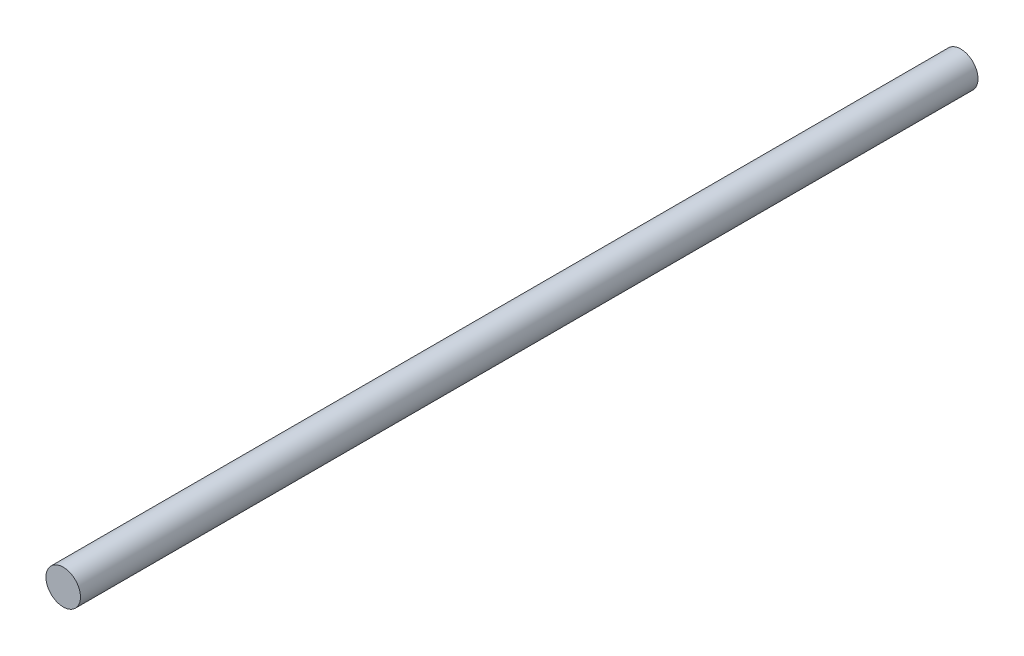
ISO-10303-21;
HEADER;
FILE_DESCRIPTION(('STEP AP214'),'2;1');
FILE_NAME('part.step','',(''),(''),'','','');
FILE_SCHEMA(('AUTOMOTIVE_DESIGN { 1 0 10303 214 1 1 1 1 }'));
ENDSEC;
DATA;
#1=APPLICATION_CONTEXT('core data for automotive mechanical design processes');
#2=APPLICATION_PROTOCOL_DEFINITION('international standard','automotive_design',2000,#1);
#3=PRODUCT_CONTEXT('',#1,'mechanical');
#4=PRODUCT('Part','Part','',(#3));
#5=PRODUCT_RELATED_PRODUCT_CATEGORY('part','',(#4));
#6=PRODUCT_DEFINITION_FORMATION('','',#4);
#7=PRODUCT_DEFINITION_CONTEXT('part definition',#1,'design');
#8=PRODUCT_DEFINITION('design','',#6,#7);
#9=PRODUCT_DEFINITION_SHAPE('','',#8);
#10=(LENGTH_UNIT() NAMED_UNIT(*) SI_UNIT(.MILLI.,.METRE.));
#11=(NAMED_UNIT(*) PLANE_ANGLE_UNIT() SI_UNIT($,.RADIAN.));
#12=(NAMED_UNIT(*) SI_UNIT($,.STERADIAN.) SOLID_ANGLE_UNIT());
#13=UNCERTAINTY_MEASURE_WITH_UNIT(LENGTH_MEASURE(1.E-05),#10,'distance_accuracy_value','');
#14=(GEOMETRIC_REPRESENTATION_CONTEXT(3) GLOBAL_UNCERTAINTY_ASSIGNED_CONTEXT((#13)) GLOBAL_UNIT_ASSIGNED_CONTEXT((#10,
#11,#12)) REPRESENTATION_CONTEXT('',''));
#15=CARTESIAN_POINT('',(0.,0.,0.));
#16=DIRECTION('',(0.,0.,1.));
#17=DIRECTION('',(1.,0.,0.));
#18=AXIS2_PLACEMENT_3D('',#15,#16,#17);
#19=CARTESIAN_POINT('',(0.,0.,165.1));
#20=DIRECTION('',(0.,0.,-1.));
#21=DIRECTION('',(-1.,0.,0.));
#22=AXIS2_PLACEMENT_3D('',#19,#20,#21);
#23=CYLINDRICAL_SURFACE('',#22,3.175);
#24=CARTESIAN_POINT('',(0.,0.,165.1));
#25=DIRECTION('',(0.,0.,1.));
#26=DIRECTION('',(1.,0.,0.));
#27=AXIS2_PLACEMENT_3D('',#24,#25,#26);
#28=CIRCLE('',#27,3.175);
#29=CARTESIAN_POINT('',(3.175,0.,165.1));
#30=VERTEX_POINT('',#29);
#31=EDGE_CURVE('E10',#30,#30,#28,.T.);
#32=ORIENTED_EDGE('',*,*,#31,.F.);
#33=EDGE_LOOP('',(#32));
#34=FACE_BOUND('',#33,.T.);
#35=CARTESIAN_POINT('',(0.,0.,0.));
#36=DIRECTION('',(0.,0.,1.));
#37=DIRECTION('',(1.,0.,0.));
#38=AXIS2_PLACEMENT_3D('',#35,#36,#37);
#39=CIRCLE('',#38,3.175);
#40=CARTESIAN_POINT('',(3.175,0.,0.));
#41=VERTEX_POINT('',#40);
#42=EDGE_CURVE('E34',#41,#41,#39,.T.);
#43=ORIENTED_EDGE('',*,*,#42,.T.);
#44=EDGE_LOOP('',(#43));
#45=FACE_BOUND('',#44,.T.);
#46=ADVANCED_FACE('F31',(#34,#45),#23,.T.);
#47=CARTESIAN_POINT('',(0.,0.,165.1));
#48=DIRECTION('',(0.,0.,1.));
#49=DIRECTION('',(1.,0.,0.));
#50=AXIS2_PLACEMENT_3D('',#47,#48,#49);
#51=PLANE('',#50);
#52=ORIENTED_EDGE('',*,*,#31,.T.);
#53=EDGE_LOOP('',(#52));
#54=FACE_BOUND('',#53,.T.);
#55=ADVANCED_FACE('F46',(#54),#51,.T.);
#56=CARTESIAN_POINT('',(0.,0.,0.));
#57=DIRECTION('',(0.,0.,1.));
#58=DIRECTION('',(1.,0.,0.));
#59=AXIS2_PLACEMENT_3D('',#56,#57,#58);
#60=PLANE('',#59);
#61=ORIENTED_EDGE('',*,*,#42,.F.);
#62=EDGE_LOOP('',(#61));
#63=FACE_BOUND('',#62,.T.);
#64=ADVANCED_FACE('F44',(#63),#60,.F.);
#65=CLOSED_SHELL('',(#46,#55,#64));
#66=MANIFOLD_SOLID_BREP('B2',#65);
#67=ADVANCED_BREP_SHAPE_REPRESENTATION('',(#18,#66),#14);
#68=SHAPE_DEFINITION_REPRESENTATION(#9,#67);
ENDSEC;
END-ISO-10303-21;
